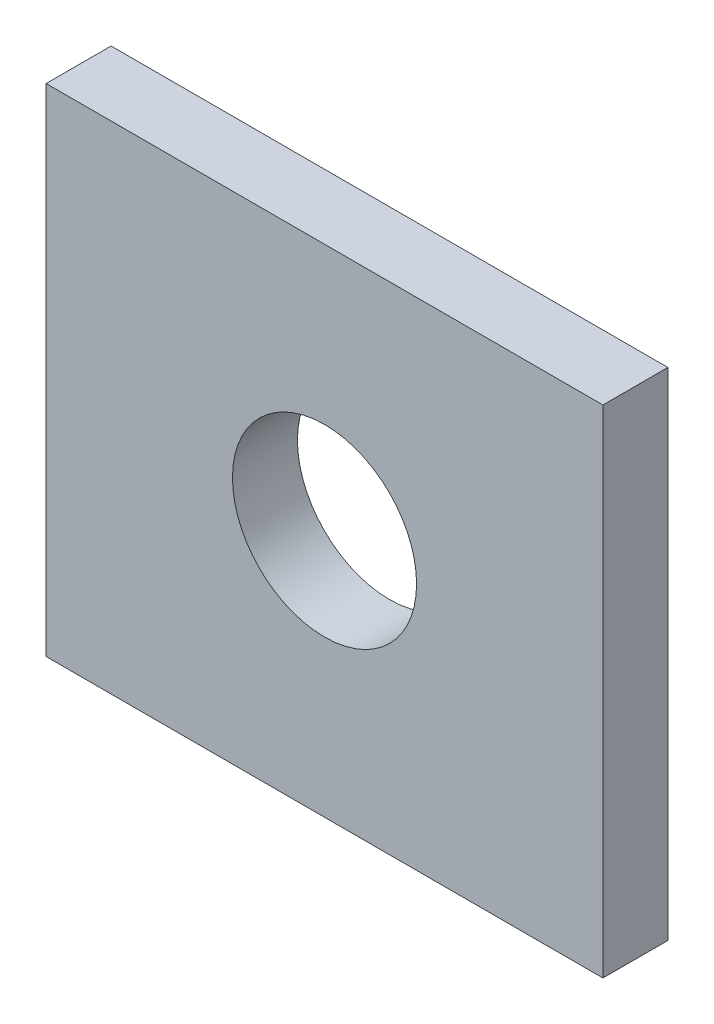
ISO-10303-21;
HEADER;
FILE_DESCRIPTION(('STEP AP214'),'2;1');
FILE_NAME('part.step','',(''),(''),'','','');
FILE_SCHEMA(('AUTOMOTIVE_DESIGN { 1 0 10303 214 1 1 1 1 }'));
ENDSEC;
DATA;
#1=APPLICATION_CONTEXT('core data for automotive mechanical design processes');
#2=APPLICATION_PROTOCOL_DEFINITION('international standard','automotive_design',2000,#1);
#3=PRODUCT_CONTEXT('',#1,'mechanical');
#4=PRODUCT('Part','Part','',(#3));
#5=PRODUCT_RELATED_PRODUCT_CATEGORY('part','',(#4));
#6=PRODUCT_DEFINITION_FORMATION('','',#4);
#7=PRODUCT_DEFINITION_CONTEXT('part definition',#1,'design');
#8=PRODUCT_DEFINITION('design','',#6,#7);
#9=PRODUCT_DEFINITION_SHAPE('','',#8);
#10=(LENGTH_UNIT() NAMED_UNIT(*) SI_UNIT(.MILLI.,.METRE.));
#11=(NAMED_UNIT(*) PLANE_ANGLE_UNIT() SI_UNIT($,.RADIAN.));
#12=(NAMED_UNIT(*) SI_UNIT($,.STERADIAN.) SOLID_ANGLE_UNIT());
#13=UNCERTAINTY_MEASURE_WITH_UNIT(LENGTH_MEASURE(1.E-05),#10,'distance_accuracy_value','');
#14=(GEOMETRIC_REPRESENTATION_CONTEXT(3) GLOBAL_UNCERTAINTY_ASSIGNED_CONTEXT((#13)) GLOBAL_UNIT_ASSIGNED_CONTEXT((#10,
#11,#12)) REPRESENTATION_CONTEXT('',''));
#15=CARTESIAN_POINT('',(0.,0.,0.));
#16=DIRECTION('',(0.,0.,1.));
#17=DIRECTION('',(1.,0.,0.));
#18=AXIS2_PLACEMENT_3D('',#15,#16,#17);
#19=CARTESIAN_POINT('',(0.,0.,6.3));
#20=DIRECTION('',(1.,0.,0.));
#21=DIRECTION('',(0.,0.,-1.));
#22=AXIS2_PLACEMENT_3D('',#19,#20,#21);
#23=PLANE('',#22);
#24=DIRECTION('',(0.,-1.,0.));
#25=VECTOR('',#24,1.);
#26=CARTESIAN_POINT('',(0.,0.,0.));
#27=LINE('',#26,#25);
#28=CARTESIAN_POINT('',(0.,48.13,0.));
#29=VERTEX_POINT('',#28);
#30=CARTESIAN_POINT('',(0.,0.,0.));
#31=VERTEX_POINT('',#30);
#32=EDGE_CURVE('E96',#29,#31,#27,.T.);
#33=ORIENTED_EDGE('',*,*,#32,.T.);
#34=DIRECTION('',(0.,0.,-1.));
#35=VECTOR('',#34,1.);
#36=CARTESIAN_POINT('',(0.,0.,6.3));
#37=LINE('',#36,#35);
#38=CARTESIAN_POINT('',(0.,0.,6.3));
#39=VERTEX_POINT('',#38);
#40=EDGE_CURVE('E11',#39,#31,#37,.T.);
#41=ORIENTED_EDGE('',*,*,#40,.F.);
#42=DIRECTION('',(0.,-1.,0.));
#43=VECTOR('',#42,1.);
#44=CARTESIAN_POINT('',(0.,0.,6.3));
#45=LINE('',#44,#43);
#46=CARTESIAN_POINT('',(0.,48.13,6.3));
#47=VERTEX_POINT('',#46);
#48=EDGE_CURVE('E84',#47,#39,#45,.T.);
#49=ORIENTED_EDGE('',*,*,#48,.F.);
#50=DIRECTION('',(0.,0.,-1.));
#51=VECTOR('',#50,1.);
#52=CARTESIAN_POINT('',(0.,48.13,6.3));
#53=LINE('',#52,#51);
#54=EDGE_CURVE('E92',#47,#29,#53,.T.);
#55=ORIENTED_EDGE('',*,*,#54,.T.);
#56=EDGE_LOOP('',(#33,#41,#49,#55));
#57=FACE_BOUND('',#56,.T.);
#58=ADVANCED_FACE('F33',(#57),#23,.F.);
#59=CARTESIAN_POINT('',(0.,0.,6.3));
#60=DIRECTION('',(0.,1.,0.));
#61=DIRECTION('',(0.,0.,1.));
#62=AXIS2_PLACEMENT_3D('',#59,#60,#61);
#63=PLANE('',#62);
#64=DIRECTION('',(1.,0.,0.));
#65=VECTOR('',#64,1.);
#66=CARTESIAN_POINT('',(0.,0.,0.));
#67=LINE('',#66,#65);
#68=CARTESIAN_POINT('',(54.,0.,0.));
#69=VERTEX_POINT('',#68);
#70=EDGE_CURVE('E88',#31,#69,#67,.T.);
#71=ORIENTED_EDGE('',*,*,#70,.T.);
#72=DIRECTION('',(0.,0.,-1.));
#73=VECTOR('',#72,1.);
#74=CARTESIAN_POINT('',(54.,0.,6.3));
#75=LINE('',#74,#73);
#76=CARTESIAN_POINT('',(54.,0.,6.3));
#77=VERTEX_POINT('',#76);
#78=EDGE_CURVE('E41',#77,#69,#75,.T.);
#79=ORIENTED_EDGE('',*,*,#78,.F.);
#80=DIRECTION('',(1.,0.,0.));
#81=VECTOR('',#80,1.);
#82=CARTESIAN_POINT('',(0.,0.,6.3));
#83=LINE('',#82,#81);
#84=EDGE_CURVE('E79',#39,#77,#83,.T.);
#85=ORIENTED_EDGE('',*,*,#84,.F.);
#86=ORIENTED_EDGE('',*,*,#40,.T.);
#87=EDGE_LOOP('',(#71,#79,#85,#86));
#88=FACE_BOUND('',#87,.T.);
#89=ADVANCED_FACE('F87',(#88),#63,.F.);
#90=CARTESIAN_POINT('',(54.,0.,6.3));
#91=DIRECTION('',(-1.,0.,0.));
#92=DIRECTION('',(0.,0.,1.));
#93=AXIS2_PLACEMENT_3D('',#90,#91,#92);
#94=PLANE('',#93);
#95=DIRECTION('',(0.,1.,0.));
#96=VECTOR('',#95,1.);
#97=CARTESIAN_POINT('',(54.,0.,0.));
#98=LINE('',#97,#96);
#99=CARTESIAN_POINT('',(54.,48.13,0.));
#100=VERTEX_POINT('',#99);
#101=EDGE_CURVE('E66',#69,#100,#98,.T.);
#102=ORIENTED_EDGE('',*,*,#101,.T.);
#103=DIRECTION('',(0.,0.,-1.));
#104=VECTOR('',#103,1.);
#105=CARTESIAN_POINT('',(54.,48.13,6.3));
#106=LINE('',#105,#104);
#107=CARTESIAN_POINT('',(54.,48.13,6.3));
#108=VERTEX_POINT('',#107);
#109=EDGE_CURVE('E89',#108,#100,#106,.T.);
#110=ORIENTED_EDGE('',*,*,#109,.F.);
#111=DIRECTION('',(0.,1.,0.));
#112=VECTOR('',#111,1.);
#113=CARTESIAN_POINT('',(54.,0.,6.3));
#114=LINE('',#113,#112);
#115=EDGE_CURVE('E82',#77,#108,#114,.T.);
#116=ORIENTED_EDGE('',*,*,#115,.F.);
#117=ORIENTED_EDGE('',*,*,#78,.T.);
#118=EDGE_LOOP('',(#102,#110,#116,#117));
#119=FACE_BOUND('',#118,.T.);
#120=ADVANCED_FACE('F90',(#119),#94,.F.);
#121=CARTESIAN_POINT('',(0.,48.13,6.3));
#122=DIRECTION('',(0.,-1.,0.));
#123=DIRECTION('',(0.,0.,-1.));
#124=AXIS2_PLACEMENT_3D('',#121,#122,#123);
#125=PLANE('',#124);
#126=DIRECTION('',(-1.,0.,0.));
#127=VECTOR('',#126,1.);
#128=CARTESIAN_POINT('',(0.,48.13,0.));
#129=LINE('',#128,#127);
#130=EDGE_CURVE('E72',#100,#29,#129,.T.);
#131=ORIENTED_EDGE('',*,*,#130,.T.);
#132=ORIENTED_EDGE('',*,*,#54,.F.);
#133=DIRECTION('',(-1.,0.,0.));
#134=VECTOR('',#133,1.);
#135=CARTESIAN_POINT('',(0.,48.13,6.3));
#136=LINE('',#135,#134);
#137=EDGE_CURVE('E49',#108,#47,#136,.T.);
#138=ORIENTED_EDGE('',*,*,#137,.F.);
#139=ORIENTED_EDGE('',*,*,#109,.T.);
#140=EDGE_LOOP('',(#131,#132,#138,#139));
#141=FACE_BOUND('',#140,.T.);
#142=ADVANCED_FACE('F104',(#141),#125,.F.);
#143=CARTESIAN_POINT('',(0.,0.,6.3));
#144=DIRECTION('',(0.,0.,-1.));
#145=DIRECTION('',(-1.,0.,0.));
#146=AXIS2_PLACEMENT_3D('',#143,#144,#145);
#147=PLANE('',#146);
#148=CARTESIAN_POINT('',(27.,24.065,6.3));
#149=DIRECTION('',(0.,0.,1.));
#150=DIRECTION('',(1.,0.,0.));
#151=AXIS2_PLACEMENT_3D('',#148,#149,#150);
#152=CIRCLE('',#151,8.9281);
#153=CARTESIAN_POINT('',(35.9281,24.065,6.3));
#154=VERTEX_POINT('',#153);
#155=EDGE_CURVE('E110',#154,#154,#152,.T.);
#156=ORIENTED_EDGE('',*,*,#155,.F.);
#157=EDGE_LOOP('',(#156));
#158=FACE_BOUND('',#157,.T.);
#159=ORIENTED_EDGE('',*,*,#48,.T.);
#160=ORIENTED_EDGE('',*,*,#84,.T.);
#161=ORIENTED_EDGE('',*,*,#115,.T.);
#162=ORIENTED_EDGE('',*,*,#137,.T.);
#163=EDGE_LOOP('',(#159,#160,#161,#162));
#164=FACE_BOUND('',#163,.T.);
#165=ADVANCED_FACE('F80',(#158,#164),#147,.F.);
#166=CARTESIAN_POINT('',(0.,0.,0.));
#167=DIRECTION('',(0.,0.,-1.));
#168=DIRECTION('',(-1.,0.,0.));
#169=AXIS2_PLACEMENT_3D('',#166,#167,#168);
#170=PLANE('',#169);
#171=CARTESIAN_POINT('',(27.,24.065,0.));
#172=DIRECTION('',(0.,0.,1.));
#173=DIRECTION('',(1.,0.,0.));
#174=AXIS2_PLACEMENT_3D('',#171,#172,#173);
#175=CIRCLE('',#174,8.9281);
#176=CARTESIAN_POINT('',(35.9281,24.065,0.));
#177=VERTEX_POINT('',#176);
#178=EDGE_CURVE('E99',#177,#177,#175,.T.);
#179=ORIENTED_EDGE('',*,*,#178,.T.);
#180=EDGE_LOOP('',(#179));
#181=FACE_BOUND('',#180,.T.);
#182=ORIENTED_EDGE('',*,*,#32,.F.);
#183=ORIENTED_EDGE('',*,*,#130,.F.);
#184=ORIENTED_EDGE('',*,*,#101,.F.);
#185=ORIENTED_EDGE('',*,*,#70,.F.);
#186=EDGE_LOOP('',(#182,#183,#184,#185));
#187=FACE_BOUND('',#186,.T.);
#188=ADVANCED_FACE('F107',(#181,#187),#170,.T.);
#189=CARTESIAN_POINT('',(27.,24.065,0.));
#190=DIRECTION('',(0.,0.,1.));
#191=DIRECTION('',(1.,0.,0.));
#192=AXIS2_PLACEMENT_3D('',#189,#190,#191);
#193=CYLINDRICAL_SURFACE('',#192,8.9281);
#194=ORIENTED_EDGE('',*,*,#178,.F.);
#195=EDGE_LOOP('',(#194));
#196=FACE_BOUND('',#195,.T.);
#197=ORIENTED_EDGE('',*,*,#155,.T.);
#198=EDGE_LOOP('',(#197));
#199=FACE_BOUND('',#198,.T.);
#200=ADVANCED_FACE('F117',(#196,#199),#193,.F.);
#201=CLOSED_SHELL('',(#58,#89,#120,#142,#165,#188,#200));
#202=MANIFOLD_SOLID_BREP('B2',#201);
#203=ADVANCED_BREP_SHAPE_REPRESENTATION('',(#18,#202),#14);
#204=SHAPE_DEFINITION_REPRESENTATION(#9,#203);
ENDSEC;
END-ISO-10303-21;
